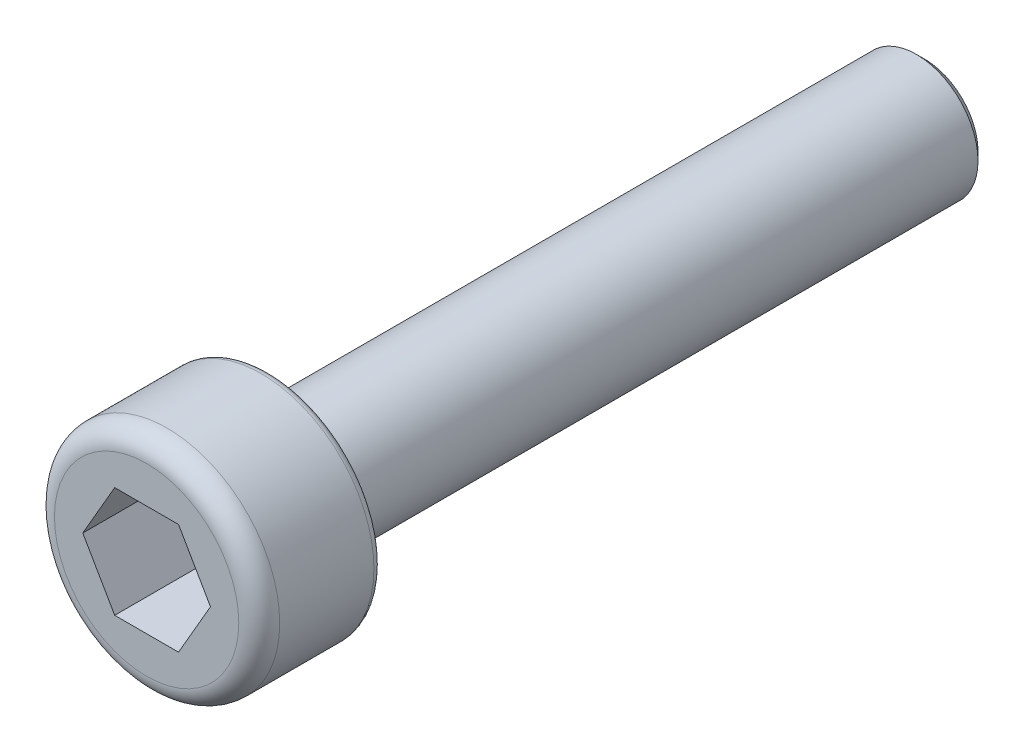
ISO-10303-21;
HEADER;
FILE_DESCRIPTION(('STEP AP214'),'2;1');
FILE_NAME('part.step','',(''),(''),'','','');
FILE_SCHEMA(('AUTOMOTIVE_DESIGN { 1 0 10303 214 1 1 1 1 }'));
ENDSEC;
DATA;
#1=APPLICATION_CONTEXT('core data for automotive mechanical design processes');
#2=APPLICATION_PROTOCOL_DEFINITION('international standard','automotive_design',2000,#1);
#3=PRODUCT_CONTEXT('',#1,'mechanical');
#4=PRODUCT('Part','Part','',(#3));
#5=PRODUCT_RELATED_PRODUCT_CATEGORY('part','',(#4));
#6=PRODUCT_DEFINITION_FORMATION('','',#4);
#7=PRODUCT_DEFINITION_CONTEXT('part definition',#1,'design');
#8=PRODUCT_DEFINITION('design','',#6,#7);
#9=PRODUCT_DEFINITION_SHAPE('','',#8);
#10=(LENGTH_UNIT() NAMED_UNIT(*) SI_UNIT(.MILLI.,.METRE.));
#11=(NAMED_UNIT(*) PLANE_ANGLE_UNIT() SI_UNIT($,.RADIAN.));
#12=(NAMED_UNIT(*) SI_UNIT($,.STERADIAN.) SOLID_ANGLE_UNIT());
#13=UNCERTAINTY_MEASURE_WITH_UNIT(LENGTH_MEASURE(1.E-05),#10,'distance_accuracy_value','');
#14=(GEOMETRIC_REPRESENTATION_CONTEXT(3) GLOBAL_UNCERTAINTY_ASSIGNED_CONTEXT((#13)) GLOBAL_UNIT_ASSIGNED_CONTEXT((#10,
#11,#12)) REPRESENTATION_CONTEXT('',''));
#15=CARTESIAN_POINT('',(0.,0.,0.));
#16=DIRECTION('',(0.,0.,1.));
#17=DIRECTION('',(1.,0.,0.));
#18=AXIS2_PLACEMENT_3D('',#15,#16,#17);
#19=CARTESIAN_POINT('',(0.,0.,0.));
#20=DIRECTION('',(0.,0.,1.));
#21=DIRECTION('',(1.,0.,0.));
#22=AXIS2_PLACEMENT_3D('',#19,#20,#21);
#23=PLANE('',#22);
#24=CARTESIAN_POINT('',(0.,0.,0.));
#25=DIRECTION('',(0.,0.,1.));
#26=DIRECTION('',(1.,0.,0.));
#27=AXIS2_PLACEMENT_3D('',#24,#25,#26);
#28=CIRCLE('',#27,2.55);
#29=CARTESIAN_POINT('',(2.55,0.,0.));
#30=VERTEX_POINT('',#29);
#31=EDGE_CURVE('E11',#30,#30,#28,.F.);
#32=ORIENTED_EDGE('',*,*,#31,.T.);
#33=EDGE_LOOP('',(#32));
#34=FACE_BOUND('',#33,.T.);
#35=CARTESIAN_POINT('',(0.,0.,0.));
#36=DIRECTION('',(0.,0.,1.));
#37=DIRECTION('',(1.,0.,0.));
#38=AXIS2_PLACEMENT_3D('',#35,#36,#37);
#39=CIRCLE('',#38,1.5);
#40=CARTESIAN_POINT('',(1.5,0.,0.));
#41=VERTEX_POINT('',#40);
#42=EDGE_CURVE('E146',#41,#41,#39,.F.);
#43=ORIENTED_EDGE('',*,*,#42,.F.);
#44=EDGE_LOOP('',(#43));
#45=FACE_BOUND('',#44,.T.);
#46=ADVANCED_FACE('F33',(#34,#45),#23,.F.);
#47=CARTESIAN_POINT('',(0.,0.,3.));
#48=DIRECTION('',(0.,0.,-1.));
#49=DIRECTION('',(-1.,0.,0.));
#50=AXIS2_PLACEMENT_3D('',#47,#48,#49);
#51=CYLINDRICAL_SURFACE('',#50,2.75);
#52=CARTESIAN_POINT('',(0.,0.,0.2));
#53=DIRECTION('',(0.,0.,1.));
#54=DIRECTION('',(1.,0.,0.));
#55=AXIS2_PLACEMENT_3D('',#52,#53,#54);
#56=CIRCLE('',#55,2.75);
#57=CARTESIAN_POINT('',(2.75,0.,0.2));
#58=VERTEX_POINT('',#57);
#59=EDGE_CURVE('E41',#58,#58,#56,.T.);
#60=ORIENTED_EDGE('',*,*,#59,.T.);
#61=EDGE_LOOP('',(#60));
#62=FACE_BOUND('',#61,.T.);
#63=CARTESIAN_POINT('',(0.,0.,2.5));
#64=DIRECTION('',(0.,0.,1.));
#65=DIRECTION('',(1.,0.,0.));
#66=AXIS2_PLACEMENT_3D('',#63,#64,#65);
#67=CIRCLE('',#66,2.75);
#68=CARTESIAN_POINT('',(2.75,0.,2.5));
#69=VERTEX_POINT('',#68);
#70=EDGE_CURVE('E143',#69,#69,#67,.F.);
#71=ORIENTED_EDGE('',*,*,#70,.T.);
#72=EDGE_LOOP('',(#71));
#73=FACE_BOUND('',#72,.T.);
#74=ADVANCED_FACE('F157',(#62,#73),#51,.T.);
#75=CARTESIAN_POINT('',(0.,0.,3.));
#76=DIRECTION('',(0.,0.,1.));
#77=DIRECTION('',(1.,0.,0.));
#78=AXIS2_PLACEMENT_3D('',#75,#76,#77);
#79=PLANE('',#78);
#80=DIRECTION('',(0.5,0.866025403784439,0.));
#81=VECTOR('',#80,1.);
#82=CARTESIAN_POINT('',(0.779422863405995,-1.35,3.));
#83=LINE('',#82,#81);
#84=CARTESIAN_POINT('',(0.779422863405995,-1.35,3.));
#85=VERTEX_POINT('',#84);
#86=CARTESIAN_POINT('',(1.55884572681199,0.,3.));
#87=VERTEX_POINT('',#86);
#88=EDGE_CURVE('E48',#85,#87,#83,.T.);
#89=ORIENTED_EDGE('',*,*,#88,.F.);
#90=DIRECTION('',(1.,0.,0.));
#91=VECTOR('',#90,1.);
#92=CARTESIAN_POINT('',(-0.779422863405994,-1.35,3.));
#93=LINE('',#92,#91);
#94=CARTESIAN_POINT('',(-0.779422863405994,-1.35,3.));
#95=VERTEX_POINT('',#94);
#96=EDGE_CURVE('E131',#95,#85,#93,.T.);
#97=ORIENTED_EDGE('',*,*,#96,.F.);
#98=DIRECTION('',(0.5,-0.866025403784438,0.));
#99=VECTOR('',#98,1.);
#100=CARTESIAN_POINT('',(-1.55884572681199,0.,3.));
#101=LINE('',#100,#99);
#102=CARTESIAN_POINT('',(-1.55884572681199,0.,3.));
#103=VERTEX_POINT('',#102);
#104=EDGE_CURVE('E129',#103,#95,#101,.T.);
#105=ORIENTED_EDGE('',*,*,#104,.F.);
#106=DIRECTION('',(-0.5,-0.866025403784438,0.));
#107=VECTOR('',#106,1.);
#108=CARTESIAN_POINT('',(-0.779422863405995,1.35,3.));
#109=LINE('',#108,#107);
#110=CARTESIAN_POINT('',(-0.779422863405995,1.35,3.));
#111=VERTEX_POINT('',#110);
#112=EDGE_CURVE('E96',#111,#103,#109,.T.);
#113=ORIENTED_EDGE('',*,*,#112,.F.);
#114=DIRECTION('',(-1.,0.,0.));
#115=VECTOR('',#114,1.);
#116=CARTESIAN_POINT('',(0.779422863405994,1.35,3.));
#117=LINE('',#116,#115);
#118=CARTESIAN_POINT('',(0.779422863405994,1.35,3.));
#119=VERTEX_POINT('',#118);
#120=EDGE_CURVE('E125',#119,#111,#117,.T.);
#121=ORIENTED_EDGE('',*,*,#120,.F.);
#122=DIRECTION('',(-0.5,0.866025403784438,0.));
#123=VECTOR('',#122,1.);
#124=CARTESIAN_POINT('',(1.55884572681199,0.,3.));
#125=LINE('',#124,#123);
#126=EDGE_CURVE('E122',#87,#119,#125,.T.);
#127=ORIENTED_EDGE('',*,*,#126,.F.);
#128=EDGE_LOOP('',(#89,#97,#105,#113,#121,#127));
#129=FACE_BOUND('',#128,.T.);
#130=CARTESIAN_POINT('',(0.,0.,3.));
#131=DIRECTION('',(0.,0.,1.));
#132=DIRECTION('',(1.,0.,0.));
#133=AXIS2_PLACEMENT_3D('',#130,#131,#132);
#134=CIRCLE('',#133,2.25);
#135=CARTESIAN_POINT('',(2.25,0.,3.));
#136=VERTEX_POINT('',#135);
#137=EDGE_CURVE('E135',#136,#136,#134,.T.);
#138=ORIENTED_EDGE('',*,*,#137,.T.);
#139=EDGE_LOOP('',(#138));
#140=FACE_BOUND('',#139,.T.);
#141=ADVANCED_FACE('F175',(#129,#140),#79,.T.);
#142=CARTESIAN_POINT('',(0.,0.,2.5));
#143=DIRECTION('',(0.,0.,1.));
#144=DIRECTION('',(1.,0.,0.));
#145=AXIS2_PLACEMENT_3D('',#142,#143,#144);
#146=TOROIDAL_SURFACE('',#145,2.25,0.5);
#147=ORIENTED_EDGE('',*,*,#70,.F.);
#148=EDGE_LOOP('',(#147));
#149=FACE_BOUND('',#148,.T.);
#150=ORIENTED_EDGE('',*,*,#137,.F.);
#151=EDGE_LOOP('',(#150));
#152=FACE_BOUND('',#151,.T.);
#153=ADVANCED_FACE('F181',(#149,#152),#146,.T.);
#154=CARTESIAN_POINT('',(0.779422863405995,-1.35,1.));
#155=DIRECTION('',(0.866025403784439,-0.5,0.));
#156=DIRECTION('',(0.5,0.866025403784439,0.));
#157=AXIS2_PLACEMENT_3D('',#154,#155,#156);
#158=PLANE('',#157);
#159=ORIENTED_EDGE('',*,*,#88,.T.);
#160=DIRECTION('',(0.,0.,1.));
#161=VECTOR('',#160,1.);
#162=CARTESIAN_POINT('',(1.55884572681199,0.,1.));
#163=LINE('',#162,#161);
#164=CARTESIAN_POINT('',(1.55884572681199,0.,1.));
#165=VERTEX_POINT('',#164);
#166=EDGE_CURVE('E78',#165,#87,#163,.T.);
#167=ORIENTED_EDGE('',*,*,#166,.F.);
#168=DIRECTION('',(0.5,0.866025403784439,0.));
#169=VECTOR('',#168,1.);
#170=CARTESIAN_POINT('',(0.779422863405995,-1.35,1.));
#171=LINE('',#170,#169);
#172=CARTESIAN_POINT('',(0.779422863405995,-1.35,1.));
#173=VERTEX_POINT('',#172);
#174=EDGE_CURVE('E133',#173,#165,#171,.T.);
#175=ORIENTED_EDGE('',*,*,#174,.F.);
#176=DIRECTION('',(0.,0.,1.));
#177=VECTOR('',#176,1.);
#178=CARTESIAN_POINT('',(0.779422863405995,-1.35,1.));
#179=LINE('',#178,#177);
#180=EDGE_CURVE('E56',#173,#85,#179,.T.);
#181=ORIENTED_EDGE('',*,*,#180,.T.);
#182=EDGE_LOOP('',(#159,#167,#175,#181));
#183=FACE_BOUND('',#182,.T.);
#184=ADVANCED_FACE('F183',(#183),#158,.F.);
#185=CARTESIAN_POINT('',(-0.779422863405994,-1.35,1.));
#186=DIRECTION('',(0.,-1.,0.));
#187=DIRECTION('',(0.,0.,-1.));
#188=AXIS2_PLACEMENT_3D('',#185,#186,#187);
#189=PLANE('',#188);
#190=ORIENTED_EDGE('',*,*,#96,.T.);
#191=ORIENTED_EDGE('',*,*,#180,.F.);
#192=DIRECTION('',(1.,0.,0.));
#193=VECTOR('',#192,1.);
#194=CARTESIAN_POINT('',(-0.779422863405994,-1.35,1.));
#195=LINE('',#194,#193);
#196=CARTESIAN_POINT('',(-0.779422863405994,-1.35,1.));
#197=VERTEX_POINT('',#196);
#198=EDGE_CURVE('E108',#197,#173,#195,.T.);
#199=ORIENTED_EDGE('',*,*,#198,.F.);
#200=DIRECTION('',(0.,0.,1.));
#201=VECTOR('',#200,1.);
#202=CARTESIAN_POINT('',(-0.779422863405994,-1.35,1.));
#203=LINE('',#202,#201);
#204=EDGE_CURVE('E100',#197,#95,#203,.T.);
#205=ORIENTED_EDGE('',*,*,#204,.T.);
#206=EDGE_LOOP('',(#190,#191,#199,#205));
#207=FACE_BOUND('',#206,.T.);
#208=ADVANCED_FACE('F189',(#207),#189,.F.);
#209=CARTESIAN_POINT('',(-1.55884572681199,0.,1.));
#210=DIRECTION('',(-0.866025403784438,-0.5,0.));
#211=DIRECTION('',(0.5,-0.866025403784438,0.));
#212=AXIS2_PLACEMENT_3D('',#209,#210,#211);
#213=PLANE('',#212);
#214=ORIENTED_EDGE('',*,*,#104,.T.);
#215=ORIENTED_EDGE('',*,*,#204,.F.);
#216=DIRECTION('',(0.5,-0.866025403784438,0.));
#217=VECTOR('',#216,1.);
#218=CARTESIAN_POINT('',(-1.55884572681199,0.,1.));
#219=LINE('',#218,#217);
#220=CARTESIAN_POINT('',(-1.55884572681199,0.,1.));
#221=VERTEX_POINT('',#220);
#222=EDGE_CURVE('E104',#221,#197,#219,.T.);
#223=ORIENTED_EDGE('',*,*,#222,.F.);
#224=DIRECTION('',(0.,0.,1.));
#225=VECTOR('',#224,1.);
#226=CARTESIAN_POINT('',(-1.55884572681199,0.,1.));
#227=LINE('',#226,#225);
#228=EDGE_CURVE('E89',#221,#103,#227,.T.);
#229=ORIENTED_EDGE('',*,*,#228,.T.);
#230=EDGE_LOOP('',(#214,#215,#223,#229));
#231=FACE_BOUND('',#230,.T.);
#232=ADVANCED_FACE('F105',(#231),#213,.F.);
#233=CARTESIAN_POINT('',(-0.779422863405995,1.35,1.));
#234=DIRECTION('',(-0.866025403784439,0.5,0.));
#235=DIRECTION('',(-0.5,-0.866025403784439,0.));
#236=AXIS2_PLACEMENT_3D('',#233,#234,#235);
#237=PLANE('',#236);
#238=ORIENTED_EDGE('',*,*,#112,.T.);
#239=ORIENTED_EDGE('',*,*,#228,.F.);
#240=DIRECTION('',(-0.5,-0.866025403784438,0.));
#241=VECTOR('',#240,1.);
#242=CARTESIAN_POINT('',(-0.779422863405995,1.35,1.));
#243=LINE('',#242,#241);
#244=CARTESIAN_POINT('',(-0.779422863405995,1.35,1.));
#245=VERTEX_POINT('',#244);
#246=EDGE_CURVE('E93',#245,#221,#243,.T.);
#247=ORIENTED_EDGE('',*,*,#246,.F.);
#248=DIRECTION('',(0.,0.,1.));
#249=VECTOR('',#248,1.);
#250=CARTESIAN_POINT('',(-0.779422863405995,1.35,1.));
#251=LINE('',#250,#249);
#252=EDGE_CURVE('E101',#245,#111,#251,.T.);
#253=ORIENTED_EDGE('',*,*,#252,.T.);
#254=EDGE_LOOP('',(#238,#239,#247,#253));
#255=FACE_BOUND('',#254,.T.);
#256=ADVANCED_FACE('F91',(#255),#237,.F.);
#257=CARTESIAN_POINT('',(0.779422863405994,1.35,1.));
#258=DIRECTION('',(0.,1.,0.));
#259=DIRECTION('',(0.,0.,1.));
#260=AXIS2_PLACEMENT_3D('',#257,#258,#259);
#261=PLANE('',#260);
#262=ORIENTED_EDGE('',*,*,#120,.T.);
#263=ORIENTED_EDGE('',*,*,#252,.F.);
#264=DIRECTION('',(-1.,0.,0.));
#265=VECTOR('',#264,1.);
#266=CARTESIAN_POINT('',(0.779422863405994,1.35,1.));
#267=LINE('',#266,#265);
#268=CARTESIAN_POINT('',(0.779422863405994,1.35,1.));
#269=VERTEX_POINT('',#268);
#270=EDGE_CURVE('E114',#269,#245,#267,.T.);
#271=ORIENTED_EDGE('',*,*,#270,.F.);
#272=DIRECTION('',(0.,0.,1.));
#273=VECTOR('',#272,1.);
#274=CARTESIAN_POINT('',(0.779422863405994,1.35,1.));
#275=LINE('',#274,#273);
#276=EDGE_CURVE('E138',#269,#119,#275,.T.);
#277=ORIENTED_EDGE('',*,*,#276,.T.);
#278=EDGE_LOOP('',(#262,#263,#271,#277));
#279=FACE_BOUND('',#278,.T.);
#280=ADVANCED_FACE('F214',(#279),#261,.F.);
#281=CARTESIAN_POINT('',(1.55884572681199,0.,1.));
#282=DIRECTION('',(0.866025403784438,0.5,0.));
#283=DIRECTION('',(-0.5,0.866025403784438,0.));
#284=AXIS2_PLACEMENT_3D('',#281,#282,#283);
#285=PLANE('',#284);
#286=ORIENTED_EDGE('',*,*,#126,.T.);
#287=ORIENTED_EDGE('',*,*,#276,.F.);
#288=DIRECTION('',(-0.5,0.866025403784438,0.));
#289=VECTOR('',#288,1.);
#290=CARTESIAN_POINT('',(1.55884572681199,0.,1.));
#291=LINE('',#290,#289);
#292=EDGE_CURVE('E116',#165,#269,#291,.T.);
#293=ORIENTED_EDGE('',*,*,#292,.F.);
#294=ORIENTED_EDGE('',*,*,#166,.T.);
#295=EDGE_LOOP('',(#286,#287,#293,#294));
#296=FACE_BOUND('',#295,.T.);
#297=ADVANCED_FACE('F201',(#296),#285,.F.);
#298=CARTESIAN_POINT('',(0.,0.,1.));
#299=DIRECTION('',(0.,0.,1.));
#300=DIRECTION('',(1.,0.,0.));
#301=AXIS2_PLACEMENT_3D('',#298,#299,#300);
#302=PLANE('',#301);
#303=ORIENTED_EDGE('',*,*,#174,.T.);
#304=ORIENTED_EDGE('',*,*,#292,.T.);
#305=ORIENTED_EDGE('',*,*,#270,.T.);
#306=ORIENTED_EDGE('',*,*,#246,.T.);
#307=ORIENTED_EDGE('',*,*,#222,.T.);
#308=ORIENTED_EDGE('',*,*,#198,.T.);
#309=EDGE_LOOP('',(#303,#304,#305,#306,#307,#308));
#310=FACE_BOUND('',#309,.T.);
#311=ADVANCED_FACE('F111',(#310),#302,.T.);
#312=CARTESIAN_POINT('',(0.,0.,-16.));
#313=DIRECTION('',(0.,0.,1.));
#314=DIRECTION('',(1.,0.,0.));
#315=AXIS2_PLACEMENT_3D('',#312,#313,#314);
#316=CYLINDRICAL_SURFACE('',#315,1.5);
#317=CARTESIAN_POINT('',(0.,0.,-15.8));
#318=DIRECTION('',(0.,0.,-1.));
#319=DIRECTION('',(-1.,0.,0.));
#320=AXIS2_PLACEMENT_3D('',#317,#318,#319);
#321=CIRCLE('',#320,1.5);
#322=CARTESIAN_POINT('',(-1.5,0.,-15.8));
#323=VERTEX_POINT('',#322);
#324=EDGE_CURVE('E152',#323,#323,#321,.F.);
#325=ORIENTED_EDGE('',*,*,#324,.T.);
#326=EDGE_LOOP('',(#325));
#327=FACE_BOUND('',#326,.T.);
#328=ORIENTED_EDGE('',*,*,#42,.T.);
#329=EDGE_LOOP('',(#328));
#330=FACE_BOUND('',#329,.T.);
#331=ADVANCED_FACE('F222',(#327,#330),#316,.T.);
#332=CARTESIAN_POINT('',(0.,0.,-16.));
#333=DIRECTION('',(0.,0.,-1.));
#334=DIRECTION('',(-1.,0.,0.));
#335=AXIS2_PLACEMENT_3D('',#332,#333,#334);
#336=PLANE('',#335);
#337=CARTESIAN_POINT('',(0.,0.,-16.));
#338=DIRECTION('',(0.,0.,-1.));
#339=DIRECTION('',(-1.,0.,0.));
#340=AXIS2_PLACEMENT_3D('',#337,#338,#339);
#341=CIRCLE('',#340,1.30000000000001);
#342=CARTESIAN_POINT('',(-1.30000000000001,0.,-16.));
#343=VERTEX_POINT('',#342);
#344=EDGE_CURVE('E149',#343,#343,#341,.T.);
#345=ORIENTED_EDGE('',*,*,#344,.T.);
#346=EDGE_LOOP('',(#345));
#347=FACE_BOUND('',#346,.T.);
#348=ADVANCED_FACE('F166',(#347),#336,.T.);
#349=CARTESIAN_POINT('',(0.,0.,-16.));
#350=DIRECTION('',(0.,0.,1.));
#351=DIRECTION('',(1.,0.,0.));
#352=AXIS2_PLACEMENT_3D('',#349,#350,#351);
#353=CONICAL_SURFACE('',#352,1.30000000000001,0.785398163397441);
#354=ORIENTED_EDGE('',*,*,#324,.F.);
#355=EDGE_LOOP('',(#354));
#356=FACE_BOUND('',#355,.T.);
#357=ORIENTED_EDGE('',*,*,#344,.F.);
#358=EDGE_LOOP('',(#357));
#359=FACE_BOUND('',#358,.T.);
#360=ADVANCED_FACE('F161',(#356,#359),#353,.T.);
#361=CARTESIAN_POINT('',(0.,0.,0.2));
#362=DIRECTION('',(0.,0.,1.));
#363=DIRECTION('',(1.,0.,0.));
#364=AXIS2_PLACEMENT_3D('',#361,#362,#363);
#365=TOROIDAL_SURFACE('',#364,2.55,0.2);
#366=ORIENTED_EDGE('',*,*,#31,.F.);
#367=EDGE_LOOP('',(#366));
#368=FACE_BOUND('',#367,.T.);
#369=ORIENTED_EDGE('',*,*,#59,.F.);
#370=EDGE_LOOP('',(#369));
#371=FACE_BOUND('',#370,.T.);
#372=ADVANCED_FACE('F35',(#368,#371),#365,.T.);
#373=CLOSED_SHELL('',(#46,#74,#141,#153,#184,#208,#232,#256,#280,#297,#311,#331,#348,#360,#372));
#374=MANIFOLD_SOLID_BREP('B2',#373);
#375=ADVANCED_BREP_SHAPE_REPRESENTATION('',(#18,#374),#14);
#376=SHAPE_DEFINITION_REPRESENTATION(#9,#375);
ENDSEC;
END-ISO-10303-21;
